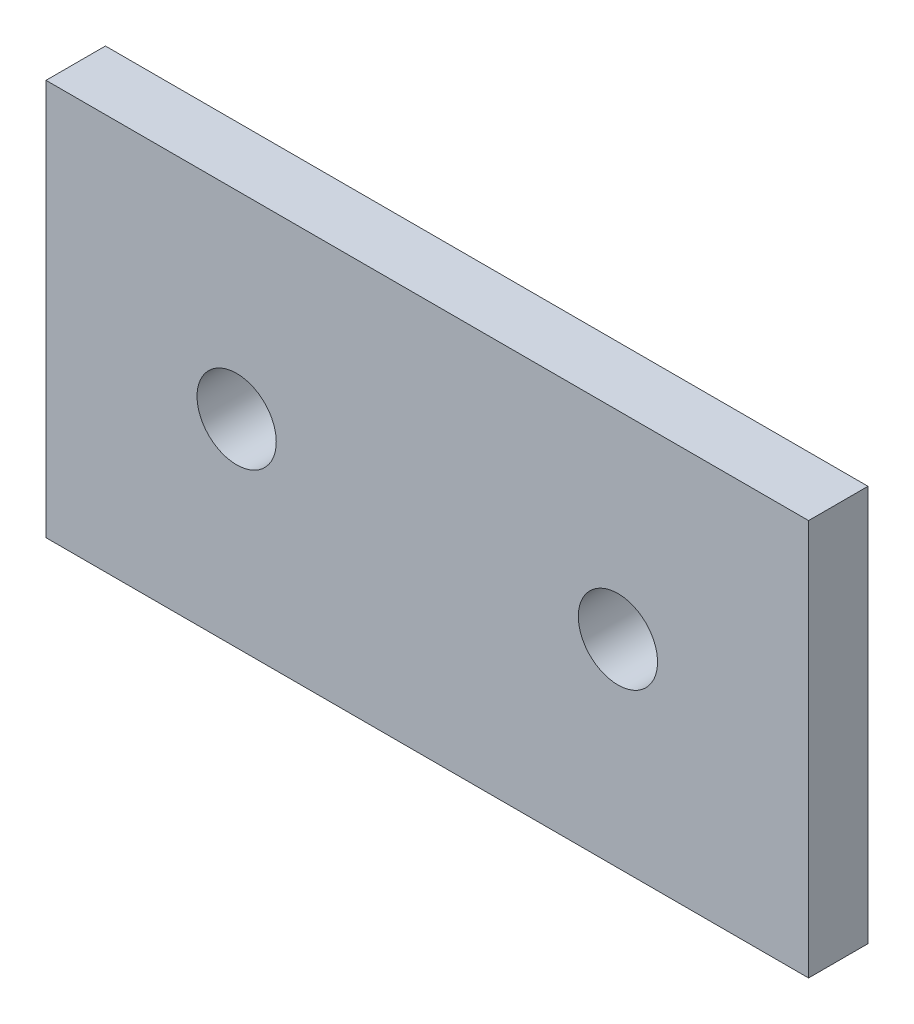
ISO-10303-21;
HEADER;
FILE_DESCRIPTION(('STEP AP214'),'2;1');
FILE_NAME('part.step','',(''),(''),'','','');
FILE_SCHEMA(('AUTOMOTIVE_DESIGN { 1 0 10303 214 1 1 1 1 }'));
ENDSEC;
DATA;
#1=APPLICATION_CONTEXT('core data for automotive mechanical design processes');
#2=APPLICATION_PROTOCOL_DEFINITION('international standard','automotive_design',2000,#1);
#3=PRODUCT_CONTEXT('',#1,'mechanical');
#4=PRODUCT('Part','Part','',(#3));
#5=PRODUCT_RELATED_PRODUCT_CATEGORY('part','',(#4));
#6=PRODUCT_DEFINITION_FORMATION('','',#4);
#7=PRODUCT_DEFINITION_CONTEXT('part definition',#1,'design');
#8=PRODUCT_DEFINITION('design','',#6,#7);
#9=PRODUCT_DEFINITION_SHAPE('','',#8);
#10=(LENGTH_UNIT() NAMED_UNIT(*) SI_UNIT(.MILLI.,.METRE.));
#11=(NAMED_UNIT(*) PLANE_ANGLE_UNIT() SI_UNIT($,.RADIAN.));
#12=(NAMED_UNIT(*) SI_UNIT($,.STERADIAN.) SOLID_ANGLE_UNIT());
#13=UNCERTAINTY_MEASURE_WITH_UNIT(LENGTH_MEASURE(1.E-05),#10,'distance_accuracy_value','');
#14=(GEOMETRIC_REPRESENTATION_CONTEXT(3) GLOBAL_UNCERTAINTY_ASSIGNED_CONTEXT((#13)) GLOBAL_UNIT_ASSIGNED_CONTEXT((#10,
#11,#12)) REPRESENTATION_CONTEXT('',''));
#15=CARTESIAN_POINT('',(0.,0.,0.));
#16=DIRECTION('',(0.,0.,1.));
#17=DIRECTION('',(1.,0.,0.));
#18=AXIS2_PLACEMENT_3D('',#15,#16,#17);
#19=CARTESIAN_POINT('',(0.,0.,3.));
#20=DIRECTION('',(0.,0.,1.));
#21=DIRECTION('',(1.,0.,0.));
#22=AXIS2_PLACEMENT_3D('',#19,#20,#21);
#23=PLANE('',#22);
#24=CARTESIAN_POINT('',(-28.875,10.,3.));
#25=DIRECTION('',(0.,0.,1.));
#26=DIRECTION('',(1.,0.,0.));
#27=AXIS2_PLACEMENT_3D('',#24,#25,#26);
#28=CIRCLE('',#27,2.);
#29=CARTESIAN_POINT('',(-26.875,10.,3.));
#30=VERTEX_POINT('',#29);
#31=EDGE_CURVE('E134',#30,#30,#28,.T.);
#32=ORIENTED_EDGE('',*,*,#31,.F.);
#33=EDGE_LOOP('',(#32));
#34=FACE_BOUND('',#33,.T.);
#35=DIRECTION('',(0.,1.,0.));
#36=VECTOR('',#35,1.);
#37=CARTESIAN_POINT('',(0.,0.,3.));
#38=LINE('',#37,#36);
#39=CARTESIAN_POINT('',(0.,0.,3.));
#40=VERTEX_POINT('',#39);
#41=CARTESIAN_POINT('',(0.,20.,3.));
#42=VERTEX_POINT('',#41);
#43=EDGE_CURVE('E96',#40,#42,#38,.T.);
#44=ORIENTED_EDGE('',*,*,#43,.T.);
#45=DIRECTION('',(-1.,0.,0.));
#46=VECTOR('',#45,1.);
#47=CARTESIAN_POINT('',(0.,20.,3.));
#48=LINE('',#47,#46);
#49=CARTESIAN_POINT('',(-38.5,20.,3.));
#50=VERTEX_POINT('',#49);
#51=EDGE_CURVE('E91',#42,#50,#48,.T.);
#52=ORIENTED_EDGE('',*,*,#51,.T.);
#53=DIRECTION('',(0.,-1.,0.));
#54=VECTOR('',#53,1.);
#55=CARTESIAN_POINT('',(-38.5,0.,3.));
#56=LINE('',#55,#54);
#57=CARTESIAN_POINT('',(-38.5,0.,3.));
#58=VERTEX_POINT('',#57);
#59=EDGE_CURVE('E94',#50,#58,#56,.T.);
#60=ORIENTED_EDGE('',*,*,#59,.T.);
#61=DIRECTION('',(1.,0.,0.));
#62=VECTOR('',#61,1.);
#63=CARTESIAN_POINT('',(0.,0.,3.));
#64=LINE('',#63,#62);
#65=EDGE_CURVE('E61',#58,#40,#64,.T.);
#66=ORIENTED_EDGE('',*,*,#65,.T.);
#67=EDGE_LOOP('',(#44,#52,#60,#66));
#68=FACE_BOUND('',#67,.T.);
#69=CARTESIAN_POINT('',(-9.625,10.,3.));
#70=DIRECTION('',(0.,0.,-1.));
#71=DIRECTION('',(-1.,0.,0.));
#72=AXIS2_PLACEMENT_3D('',#69,#70,#71);
#73=CIRCLE('',#72,2.);
#74=CARTESIAN_POINT('',(-11.625,10.,3.));
#75=VERTEX_POINT('',#74);
#76=EDGE_CURVE('E116',#75,#75,#73,.T.);
#77=ORIENTED_EDGE('',*,*,#76,.T.);
#78=EDGE_LOOP('',(#77));
#79=FACE_BOUND('',#78,.T.);
#80=ADVANCED_FACE('F43',(#34,#68,#79),#23,.T.);
#81=CARTESIAN_POINT('',(0.,0.,0.));
#82=DIRECTION('',(0.,0.,1.));
#83=DIRECTION('',(1.,0.,0.));
#84=AXIS2_PLACEMENT_3D('',#81,#82,#83);
#85=PLANE('',#84);
#86=DIRECTION('',(0.,1.,0.));
#87=VECTOR('',#86,1.);
#88=CARTESIAN_POINT('',(0.,0.,0.));
#89=LINE('',#88,#87);
#90=CARTESIAN_POINT('',(0.,0.,0.));
#91=VERTEX_POINT('',#90);
#92=CARTESIAN_POINT('',(0.,20.,0.));
#93=VERTEX_POINT('',#92);
#94=EDGE_CURVE('E112',#91,#93,#89,.T.);
#95=ORIENTED_EDGE('',*,*,#94,.F.);
#96=DIRECTION('',(1.,0.,0.));
#97=VECTOR('',#96,1.);
#98=CARTESIAN_POINT('',(0.,0.,0.));
#99=LINE('',#98,#97);
#100=CARTESIAN_POINT('',(-38.5,0.,0.));
#101=VERTEX_POINT('',#100);
#102=EDGE_CURVE('E84',#101,#91,#99,.T.);
#103=ORIENTED_EDGE('',*,*,#102,.F.);
#104=DIRECTION('',(0.,-1.,0.));
#105=VECTOR('',#104,1.);
#106=CARTESIAN_POINT('',(-38.5,0.,0.));
#107=LINE('',#106,#105);
#108=CARTESIAN_POINT('',(-38.5,20.,0.));
#109=VERTEX_POINT('',#108);
#110=EDGE_CURVE('E78',#109,#101,#107,.T.);
#111=ORIENTED_EDGE('',*,*,#110,.F.);
#112=DIRECTION('',(-1.,0.,0.));
#113=VECTOR('',#112,1.);
#114=CARTESIAN_POINT('',(0.,20.,0.));
#115=LINE('',#114,#113);
#116=EDGE_CURVE('E101',#93,#109,#115,.T.);
#117=ORIENTED_EDGE('',*,*,#116,.F.);
#118=EDGE_LOOP('',(#95,#103,#111,#117));
#119=FACE_BOUND('',#118,.T.);
#120=CARTESIAN_POINT('',(-28.875,10.,0.));
#121=DIRECTION('',(0.,0.,1.));
#122=DIRECTION('',(1.,0.,0.));
#123=AXIS2_PLACEMENT_3D('',#120,#121,#122);
#124=CIRCLE('',#123,2.);
#125=CARTESIAN_POINT('',(-26.875,10.,0.));
#126=VERTEX_POINT('',#125);
#127=EDGE_CURVE('E138',#126,#126,#124,.T.);
#128=ORIENTED_EDGE('',*,*,#127,.T.);
#129=EDGE_LOOP('',(#128));
#130=FACE_BOUND('',#129,.T.);
#131=CARTESIAN_POINT('',(-9.625,10.,0.));
#132=DIRECTION('',(0.,0.,-1.));
#133=DIRECTION('',(-1.,0.,0.));
#134=AXIS2_PLACEMENT_3D('',#131,#132,#133);
#135=CIRCLE('',#134,2.);
#136=CARTESIAN_POINT('',(-11.625,10.,0.));
#137=VERTEX_POINT('',#136);
#138=EDGE_CURVE('E142',#137,#137,#135,.T.);
#139=ORIENTED_EDGE('',*,*,#138,.F.);
#140=EDGE_LOOP('',(#139));
#141=FACE_BOUND('',#140,.T.);
#142=ADVANCED_FACE('F129',(#119,#130,#141),#85,.F.);
#143=CARTESIAN_POINT('',(0.,0.,3.));
#144=DIRECTION('',(-1.,0.,0.));
#145=DIRECTION('',(0.,-1.,0.));
#146=AXIS2_PLACEMENT_3D('',#143,#144,#145);
#147=PLANE('',#146);
#148=ORIENTED_EDGE('',*,*,#94,.T.);
#149=DIRECTION('',(0.,0.,-1.));
#150=VECTOR('',#149,1.);
#151=CARTESIAN_POINT('',(0.,20.,3.));
#152=LINE('',#151,#150);
#153=EDGE_CURVE('E11',#42,#93,#152,.T.);
#154=ORIENTED_EDGE('',*,*,#153,.F.);
#155=ORIENTED_EDGE('',*,*,#43,.F.);
#156=DIRECTION('',(0.,0.,-1.));
#157=VECTOR('',#156,1.);
#158=CARTESIAN_POINT('',(0.,0.,3.));
#159=LINE('',#158,#157);
#160=EDGE_CURVE('E108',#40,#91,#159,.T.);
#161=ORIENTED_EDGE('',*,*,#160,.T.);
#162=EDGE_LOOP('',(#148,#154,#155,#161));
#163=FACE_BOUND('',#162,.T.);
#164=ADVANCED_FACE('F45',(#163),#147,.F.);
#165=CARTESIAN_POINT('',(0.,20.,3.));
#166=DIRECTION('',(0.,-1.,0.));
#167=DIRECTION('',(1.,0.,0.));
#168=AXIS2_PLACEMENT_3D('',#165,#166,#167);
#169=PLANE('',#168);
#170=ORIENTED_EDGE('',*,*,#116,.T.);
#171=DIRECTION('',(0.,0.,-1.));
#172=VECTOR('',#171,1.);
#173=CARTESIAN_POINT('',(-38.5,20.,3.));
#174=LINE('',#173,#172);
#175=EDGE_CURVE('E53',#50,#109,#174,.T.);
#176=ORIENTED_EDGE('',*,*,#175,.F.);
#177=ORIENTED_EDGE('',*,*,#51,.F.);
#178=ORIENTED_EDGE('',*,*,#153,.T.);
#179=EDGE_LOOP('',(#170,#176,#177,#178));
#180=FACE_BOUND('',#179,.T.);
#181=ADVANCED_FACE('F100',(#180),#169,.F.);
#182=CARTESIAN_POINT('',(-38.5,0.,3.));
#183=DIRECTION('',(1.,0.,0.));
#184=DIRECTION('',(0.,0.,-1.));
#185=AXIS2_PLACEMENT_3D('',#182,#183,#184);
#186=PLANE('',#185);
#187=ORIENTED_EDGE('',*,*,#110,.T.);
#188=DIRECTION('',(0.,0.,-1.));
#189=VECTOR('',#188,1.);
#190=CARTESIAN_POINT('',(-38.5,0.,3.));
#191=LINE('',#190,#189);
#192=EDGE_CURVE('E103',#58,#101,#191,.T.);
#193=ORIENTED_EDGE('',*,*,#192,.F.);
#194=ORIENTED_EDGE('',*,*,#59,.F.);
#195=ORIENTED_EDGE('',*,*,#175,.T.);
#196=EDGE_LOOP('',(#187,#193,#194,#195));
#197=FACE_BOUND('',#196,.T.);
#198=ADVANCED_FACE('F104',(#197),#186,.F.);
#199=CARTESIAN_POINT('',(0.,0.,3.));
#200=DIRECTION('',(0.,1.,0.));
#201=DIRECTION('',(0.,0.,1.));
#202=AXIS2_PLACEMENT_3D('',#199,#200,#201);
#203=PLANE('',#202);
#204=ORIENTED_EDGE('',*,*,#102,.T.);
#205=ORIENTED_EDGE('',*,*,#160,.F.);
#206=ORIENTED_EDGE('',*,*,#65,.F.);
#207=ORIENTED_EDGE('',*,*,#192,.T.);
#208=EDGE_LOOP('',(#204,#205,#206,#207));
#209=FACE_BOUND('',#208,.T.);
#210=ADVANCED_FACE('F126',(#209),#203,.F.);
#211=CARTESIAN_POINT('',(-28.875,10.,3.));
#212=DIRECTION('',(0.,0.,-1.));
#213=DIRECTION('',(-1.,0.,0.));
#214=AXIS2_PLACEMENT_3D('',#211,#212,#213);
#215=CYLINDRICAL_SURFACE('',#214,2.);
#216=ORIENTED_EDGE('',*,*,#31,.T.);
#217=EDGE_LOOP('',(#216));
#218=FACE_BOUND('',#217,.T.);
#219=ORIENTED_EDGE('',*,*,#127,.F.);
#220=EDGE_LOOP('',(#219));
#221=FACE_BOUND('',#220,.T.);
#222=ADVANCED_FACE('F153',(#218,#221),#215,.F.);
#223=CARTESIAN_POINT('',(-9.625,10.,3.));
#224=DIRECTION('',(0.,0.,-1.));
#225=DIRECTION('',(-1.,0.,0.));
#226=AXIS2_PLACEMENT_3D('',#223,#224,#225);
#227=CYLINDRICAL_SURFACE('',#226,2.);
#228=ORIENTED_EDGE('',*,*,#76,.F.);
#229=EDGE_LOOP('',(#228));
#230=FACE_BOUND('',#229,.T.);
#231=ORIENTED_EDGE('',*,*,#138,.T.);
#232=EDGE_LOOP('',(#231));
#233=FACE_BOUND('',#232,.T.);
#234=ADVANCED_FACE('F150',(#230,#233),#227,.F.);
#235=CLOSED_SHELL('',(#80,#142,#164,#181,#198,#210,#222,#234));
#236=MANIFOLD_SOLID_BREP('B2',#235);
#237=ADVANCED_BREP_SHAPE_REPRESENTATION('',(#18,#236),#14);
#238=SHAPE_DEFINITION_REPRESENTATION(#9,#237);
ENDSEC;
END-ISO-10303-21;
